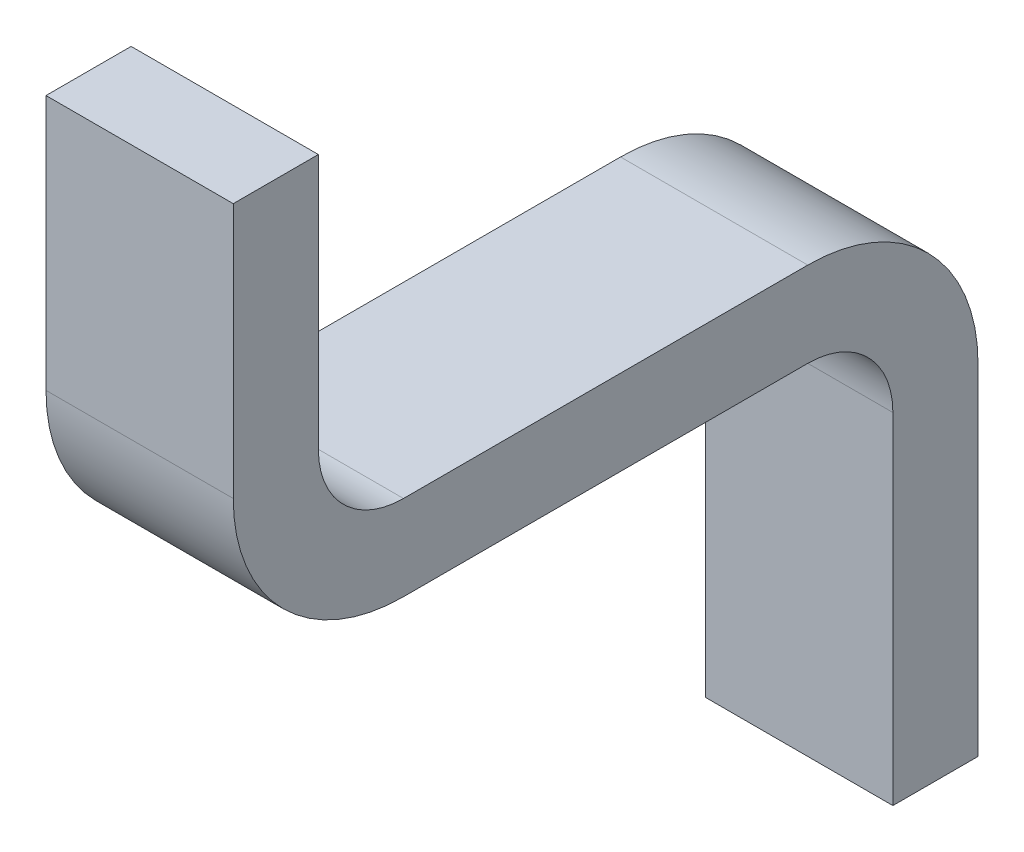
ISO-10303-21;
HEADER;
FILE_DESCRIPTION(('STEP AP214'),'2;1');
FILE_NAME('part.step','',(''),(''),'','','');
FILE_SCHEMA(('AUTOMOTIVE_DESIGN { 1 0 10303 214 1 1 1 1 }'));
ENDSEC;
DATA;
#1=APPLICATION_CONTEXT('core data for automotive mechanical design processes');
#2=APPLICATION_PROTOCOL_DEFINITION('international standard','automotive_design',2000,#1);
#3=PRODUCT_CONTEXT('',#1,'mechanical');
#4=PRODUCT('Part','Part','',(#3));
#5=PRODUCT_RELATED_PRODUCT_CATEGORY('part','',(#4));
#6=PRODUCT_DEFINITION_FORMATION('','',#4);
#7=PRODUCT_DEFINITION_CONTEXT('part definition',#1,'design');
#8=PRODUCT_DEFINITION('design','',#6,#7);
#9=PRODUCT_DEFINITION_SHAPE('','',#8);
#10=(LENGTH_UNIT() NAMED_UNIT(*) SI_UNIT(.MILLI.,.METRE.));
#11=(NAMED_UNIT(*) PLANE_ANGLE_UNIT() SI_UNIT($,.RADIAN.));
#12=(NAMED_UNIT(*) SI_UNIT($,.STERADIAN.) SOLID_ANGLE_UNIT());
#13=UNCERTAINTY_MEASURE_WITH_UNIT(LENGTH_MEASURE(1.E-05),#10,'distance_accuracy_value','');
#14=(GEOMETRIC_REPRESENTATION_CONTEXT(3) GLOBAL_UNCERTAINTY_ASSIGNED_CONTEXT((#13)) GLOBAL_UNIT_ASSIGNED_CONTEXT((#10,
#11,#12)) REPRESENTATION_CONTEXT('',''));
#15=CARTESIAN_POINT('',(0.,0.,0.));
#16=DIRECTION('',(0.,0.,1.));
#17=DIRECTION('',(1.,0.,0.));
#18=AXIS2_PLACEMENT_3D('',#15,#16,#17);
#19=CARTESIAN_POINT('',(1.64,-4.,0.675));
#20=DIRECTION('',(1.,0.,0.));
#21=DIRECTION('',(0.,1.,0.));
#22=AXIS2_PLACEMENT_3D('',#19,#20,#21);
#23=PLANE('',#22);
#24=CARTESIAN_POINT('',(1.64,-3.8,0.675));
#25=DIRECTION('',(-1.,0.,0.));
#26=DIRECTION('',(0.,-1.,0.));
#27=AXIS2_PLACEMENT_3D('',#24,#25,#26);
#28=CIRCLE('',#27,0.2);
#29=CARTESIAN_POINT('',(1.64,-3.8,0.875));
#30=VERTEX_POINT('',#29);
#31=CARTESIAN_POINT('',(1.64,-4.,0.675));
#32=VERTEX_POINT('',#31);
#33=EDGE_CURVE('E150',#30,#32,#28,.F.);
#34=ORIENTED_EDGE('',*,*,#33,.F.);
#35=DIRECTION('',(0.,1.,0.));
#36=VECTOR('',#35,1.);
#37=CARTESIAN_POINT('',(1.64,-3.50000000000001,0.875));
#38=LINE('',#37,#36);
#39=CARTESIAN_POINT('',(1.64,-3.50000000000001,0.875));
#40=VERTEX_POINT('',#39);
#41=EDGE_CURVE('E147',#30,#40,#38,.T.);
#42=ORIENTED_EDGE('',*,*,#41,.T.);
#43=DIRECTION('',(0.,0.,1.));
#44=VECTOR('',#43,1.);
#45=CARTESIAN_POINT('',(1.64,-3.50000000000001,0.775));
#46=LINE('',#45,#44);
#47=CARTESIAN_POINT('',(1.64,-3.50000000000001,0.775));
#48=VERTEX_POINT('',#47);
#49=EDGE_CURVE('E141',#48,#40,#46,.T.);
#50=ORIENTED_EDGE('',*,*,#49,.F.);
#51=DIRECTION('',(0.,1.,0.));
#52=VECTOR('',#51,1.);
#53=CARTESIAN_POINT('',(1.64,-3.50000000000001,0.775));
#54=LINE('',#53,#52);
#55=CARTESIAN_POINT('',(1.64,-3.8,0.775));
#56=VERTEX_POINT('',#55);
#57=EDGE_CURVE('E115',#48,#56,#54,.F.);
#58=ORIENTED_EDGE('',*,*,#57,.T.);
#59=CARTESIAN_POINT('',(1.64,-3.8,0.675));
#60=DIRECTION('',(-1.,0.,0.));
#61=DIRECTION('',(0.,-1.,0.));
#62=AXIS2_PLACEMENT_3D('',#59,#60,#61);
#63=CIRCLE('',#62,0.1);
#64=CARTESIAN_POINT('',(1.64,-3.90000000000001,0.675));
#65=VERTEX_POINT('',#64);
#66=EDGE_CURVE('E215',#56,#65,#63,.F.);
#67=ORIENTED_EDGE('',*,*,#66,.T.);
#68=DIRECTION('',(0.,0.,1.));
#69=VECTOR('',#68,1.);
#70=CARTESIAN_POINT('',(1.64,-3.90000000000001,0.675));
#71=LINE('',#70,#69);
#72=CARTESIAN_POINT('',(1.64,-3.90000000000001,0.2));
#73=VERTEX_POINT('',#72);
#74=EDGE_CURVE('E181',#65,#73,#71,.F.);
#75=ORIENTED_EDGE('',*,*,#74,.T.);
#76=CARTESIAN_POINT('',(1.64,-4.1,0.2));
#77=DIRECTION('',(1.,0.,0.));
#78=DIRECTION('',(0.,1.,0.));
#79=AXIS2_PLACEMENT_3D('',#76,#77,#78);
#80=CIRCLE('',#79,0.2);
#81=CARTESIAN_POINT('',(1.64,-4.1,0.));
#82=VERTEX_POINT('',#81);
#83=EDGE_CURVE('E20',#82,#73,#80,.T.);
#84=ORIENTED_EDGE('',*,*,#83,.F.);
#85=DIRECTION('',(0.,1.,0.));
#86=VECTOR('',#85,1.);
#87=CARTESIAN_POINT('',(1.64,-4.1,0.));
#88=LINE('',#87,#86);
#89=CARTESIAN_POINT('',(1.64,-4.5,0.));
#90=VERTEX_POINT('',#89);
#91=EDGE_CURVE('E91',#82,#90,#88,.F.);
#92=ORIENTED_EDGE('',*,*,#91,.T.);
#93=DIRECTION('',(0.,0.,1.));
#94=VECTOR('',#93,1.);
#95=CARTESIAN_POINT('',(1.64,-4.5,0.));
#96=LINE('',#95,#94);
#97=CARTESIAN_POINT('',(1.64,-4.5,0.1));
#98=VERTEX_POINT('',#97);
#99=EDGE_CURVE('E163',#90,#98,#96,.T.);
#100=ORIENTED_EDGE('',*,*,#99,.T.);
#101=DIRECTION('',(0.,1.,0.));
#102=VECTOR('',#101,1.);
#103=CARTESIAN_POINT('',(1.64,-4.1,0.1));
#104=LINE('',#103,#102);
#105=CARTESIAN_POINT('',(1.64,-4.1,0.1));
#106=VERTEX_POINT('',#105);
#107=EDGE_CURVE('E159',#98,#106,#104,.T.);
#108=ORIENTED_EDGE('',*,*,#107,.T.);
#109=CARTESIAN_POINT('',(1.64,-4.1,0.2));
#110=DIRECTION('',(1.,0.,0.));
#111=DIRECTION('',(0.,1.,0.));
#112=AXIS2_PLACEMENT_3D('',#109,#110,#111);
#113=CIRCLE('',#112,0.1);
#114=CARTESIAN_POINT('',(1.64,-4.,0.2));
#115=VERTEX_POINT('',#114);
#116=EDGE_CURVE('E155',#106,#115,#113,.T.);
#117=ORIENTED_EDGE('',*,*,#116,.T.);
#118=DIRECTION('',(0.,0.,1.));
#119=VECTOR('',#118,1.);
#120=CARTESIAN_POINT('',(1.64,-4.,0.675));
#121=LINE('',#120,#119);
#122=EDGE_CURVE('E154',#115,#32,#121,.T.);
#123=ORIENTED_EDGE('',*,*,#122,.T.);
#124=EDGE_LOOP('',(#34,#42,#50,#58,#67,#75,#84,#92,#100,#108,#117,#123));
#125=FACE_BOUND('',#124,.T.);
#126=ADVANCED_FACE('F17',(#125),#23,.F.);
#127=CARTESIAN_POINT('',(1.64,-4.1,0.2));
#128=DIRECTION('',(1.,0.,0.));
#129=DIRECTION('',(0.,1.,0.));
#130=AXIS2_PLACEMENT_3D('',#127,#128,#129);
#131=CYLINDRICAL_SURFACE('',#130,0.2);
#132=CARTESIAN_POINT('',(1.86,-4.1,0.2));
#133=DIRECTION('',(1.,0.,0.));
#134=DIRECTION('',(0.,1.,0.));
#135=AXIS2_PLACEMENT_3D('',#132,#133,#134);
#136=CIRCLE('',#135,0.2);
#137=CARTESIAN_POINT('',(1.86,-3.9,0.2));
#138=VERTEX_POINT('',#137);
#139=CARTESIAN_POINT('',(1.86,-4.1,0.));
#140=VERTEX_POINT('',#139);
#141=EDGE_CURVE('E183',#138,#140,#136,.F.);
#142=ORIENTED_EDGE('',*,*,#141,.T.);
#143=DIRECTION('',(1.,0.,0.));
#144=VECTOR('',#143,1.);
#145=CARTESIAN_POINT('',(1.64,-4.1,0.));
#146=LINE('',#145,#144);
#147=EDGE_CURVE('E178',#140,#82,#146,.F.);
#148=ORIENTED_EDGE('',*,*,#147,.T.);
#149=ORIENTED_EDGE('',*,*,#83,.T.);
#150=DIRECTION('',(1.,0.,0.));
#151=VECTOR('',#150,1.);
#152=CARTESIAN_POINT('',(1.64,-3.90000000000001,0.2));
#153=LINE('',#152,#151);
#154=EDGE_CURVE('E217',#73,#138,#153,.T.);
#155=ORIENTED_EDGE('',*,*,#154,.T.);
#156=EDGE_LOOP('',(#142,#148,#149,#155));
#157=FACE_BOUND('',#156,.T.);
#158=ADVANCED_FACE('F254',(#157),#131,.T.);
#159=CARTESIAN_POINT('',(1.64,-4.1,0.));
#160=DIRECTION('',(0.,0.,1.));
#161=DIRECTION('',(1.,0.,0.));
#162=AXIS2_PLACEMENT_3D('',#159,#160,#161);
#163=PLANE('',#162);
#164=ORIENTED_EDGE('',*,*,#147,.F.);
#165=DIRECTION('',(0.,-1.,0.));
#166=VECTOR('',#165,1.);
#167=CARTESIAN_POINT('',(1.86,-3.9,0.));
#168=LINE('',#167,#166);
#169=CARTESIAN_POINT('',(1.86,-4.5,0.));
#170=VERTEX_POINT('',#169);
#171=EDGE_CURVE('E170',#140,#170,#168,.T.);
#172=ORIENTED_EDGE('',*,*,#171,.T.);
#173=DIRECTION('',(-1.,0.,0.));
#174=VECTOR('',#173,1.);
#175=CARTESIAN_POINT('',(1.64,-4.5,0.));
#176=LINE('',#175,#174);
#177=EDGE_CURVE('E173',#170,#90,#176,.T.);
#178=ORIENTED_EDGE('',*,*,#177,.T.);
#179=ORIENTED_EDGE('',*,*,#91,.F.);
#180=EDGE_LOOP('',(#164,#172,#178,#179));
#181=FACE_BOUND('',#180,.T.);
#182=ADVANCED_FACE('F257',(#181),#163,.F.);
#183=CARTESIAN_POINT('',(1.64,-4.5,0.));
#184=DIRECTION('',(0.,1.,0.));
#185=DIRECTION('',(-1.,0.,0.));
#186=AXIS2_PLACEMENT_3D('',#183,#184,#185);
#187=PLANE('',#186);
#188=DIRECTION('',(-1.,0.,0.));
#189=VECTOR('',#188,1.);
#190=CARTESIAN_POINT('',(1.86,-4.5,0.1));
#191=LINE('',#190,#189);
#192=CARTESIAN_POINT('',(1.86,-4.5,0.1));
#193=VERTEX_POINT('',#192);
#194=EDGE_CURVE('E160',#193,#98,#191,.T.);
#195=ORIENTED_EDGE('',*,*,#194,.T.);
#196=ORIENTED_EDGE('',*,*,#99,.F.);
#197=ORIENTED_EDGE('',*,*,#177,.F.);
#198=DIRECTION('',(0.,0.,1.));
#199=VECTOR('',#198,1.);
#200=CARTESIAN_POINT('',(1.86,-4.5,0.675));
#201=LINE('',#200,#199);
#202=EDGE_CURVE('E166',#170,#193,#201,.T.);
#203=ORIENTED_EDGE('',*,*,#202,.T.);
#204=EDGE_LOOP('',(#195,#196,#197,#203));
#205=FACE_BOUND('',#204,.T.);
#206=ADVANCED_FACE('F259',(#205),#187,.F.);
#207=CARTESIAN_POINT('',(1.86,-4.1,0.1));
#208=DIRECTION('',(0.,0.,-1.));
#209=DIRECTION('',(-1.,0.,0.));
#210=AXIS2_PLACEMENT_3D('',#207,#208,#209);
#211=PLANE('',#210);
#212=DIRECTION('',(1.,0.,0.));
#213=VECTOR('',#212,1.);
#214=CARTESIAN_POINT('',(1.86,-4.1,0.1));
#215=LINE('',#214,#213);
#216=CARTESIAN_POINT('',(1.86,-4.1,0.1));
#217=VERTEX_POINT('',#216);
#218=EDGE_CURVE('E156',#217,#106,#215,.F.);
#219=ORIENTED_EDGE('',*,*,#218,.T.);
#220=ORIENTED_EDGE('',*,*,#107,.F.);
#221=ORIENTED_EDGE('',*,*,#194,.F.);
#222=DIRECTION('',(0.,-1.,0.));
#223=VECTOR('',#222,1.);
#224=CARTESIAN_POINT('',(1.86,-3.9,0.1));
#225=LINE('',#224,#223);
#226=EDGE_CURVE('E169',#193,#217,#225,.F.);
#227=ORIENTED_EDGE('',*,*,#226,.T.);
#228=EDGE_LOOP('',(#219,#220,#221,#227));
#229=FACE_BOUND('',#228,.T.);
#230=ADVANCED_FACE('F234',(#229),#211,.F.);
#231=CARTESIAN_POINT('',(1.86,-4.1,0.2));
#232=DIRECTION('',(1.,0.,0.));
#233=DIRECTION('',(0.,1.,0.));
#234=AXIS2_PLACEMENT_3D('',#231,#232,#233);
#235=CYLINDRICAL_SURFACE('',#234,0.1);
#236=DIRECTION('',(-1.,0.,0.));
#237=VECTOR('',#236,1.);
#238=CARTESIAN_POINT('',(1.86,-4.,0.2));
#239=LINE('',#238,#237);
#240=CARTESIAN_POINT('',(1.86,-4.,0.2));
#241=VERTEX_POINT('',#240);
#242=EDGE_CURVE('E151',#241,#115,#239,.T.);
#243=ORIENTED_EDGE('',*,*,#242,.T.);
#244=ORIENTED_EDGE('',*,*,#116,.F.);
#245=ORIENTED_EDGE('',*,*,#218,.F.);
#246=CARTESIAN_POINT('',(1.86,-4.1,0.2));
#247=DIRECTION('',(1.,0.,0.));
#248=DIRECTION('',(0.,1.,0.));
#249=AXIS2_PLACEMENT_3D('',#246,#247,#248);
#250=CIRCLE('',#249,0.1);
#251=EDGE_CURVE('E210',#217,#241,#250,.T.);
#252=ORIENTED_EDGE('',*,*,#251,.T.);
#253=EDGE_LOOP('',(#243,#244,#245,#252));
#254=FACE_BOUND('',#253,.T.);
#255=ADVANCED_FACE('F227',(#254),#235,.F.);
#256=CARTESIAN_POINT('',(1.86,-4.,0.675));
#257=DIRECTION('',(0.,1.,0.));
#258=DIRECTION('',(-1.,0.,0.));
#259=AXIS2_PLACEMENT_3D('',#256,#257,#258);
#260=PLANE('',#259);
#261=DIRECTION('',(-1.,0.,0.));
#262=VECTOR('',#261,1.);
#263=CARTESIAN_POINT('',(1.86,-4.,0.675));
#264=LINE('',#263,#262);
#265=CARTESIAN_POINT('',(1.86,-4.,0.675));
#266=VERTEX_POINT('',#265);
#267=EDGE_CURVE('E148',#32,#266,#264,.F.);
#268=ORIENTED_EDGE('',*,*,#267,.F.);
#269=ORIENTED_EDGE('',*,*,#122,.F.);
#270=ORIENTED_EDGE('',*,*,#242,.F.);
#271=DIRECTION('',(0.,0.,1.));
#272=VECTOR('',#271,1.);
#273=CARTESIAN_POINT('',(1.86,-4.,0.675));
#274=LINE('',#273,#272);
#275=EDGE_CURVE('E209',#241,#266,#274,.T.);
#276=ORIENTED_EDGE('',*,*,#275,.T.);
#277=EDGE_LOOP('',(#268,#269,#270,#276));
#278=FACE_BOUND('',#277,.T.);
#279=ADVANCED_FACE('F224',(#278),#260,.F.);
#280=CARTESIAN_POINT('',(1.86,-3.8,0.675));
#281=DIRECTION('',(-1.,0.,0.));
#282=DIRECTION('',(0.,-1.,0.));
#283=AXIS2_PLACEMENT_3D('',#280,#281,#282);
#284=CYLINDRICAL_SURFACE('',#283,0.2);
#285=ORIENTED_EDGE('',*,*,#33,.T.);
#286=ORIENTED_EDGE('',*,*,#267,.T.);
#287=CARTESIAN_POINT('',(1.86,-3.8,0.675));
#288=DIRECTION('',(-1.,0.,0.));
#289=DIRECTION('',(0.,-1.,0.));
#290=AXIS2_PLACEMENT_3D('',#287,#288,#289);
#291=CIRCLE('',#290,0.2);
#292=CARTESIAN_POINT('',(1.86,-3.8,0.875));
#293=VERTEX_POINT('',#292);
#294=EDGE_CURVE('E133',#266,#293,#291,.T.);
#295=ORIENTED_EDGE('',*,*,#294,.T.);
#296=DIRECTION('',(-1.,0.,0.));
#297=VECTOR('',#296,1.);
#298=CARTESIAN_POINT('',(1.86,-3.8,0.875));
#299=LINE('',#298,#297);
#300=EDGE_CURVE('E144',#293,#30,#299,.T.);
#301=ORIENTED_EDGE('',*,*,#300,.T.);
#302=EDGE_LOOP('',(#285,#286,#295,#301));
#303=FACE_BOUND('',#302,.T.);
#304=ADVANCED_FACE('F285',(#303),#284,.T.);
#305=CARTESIAN_POINT('',(1.86,-3.50000000000001,0.875));
#306=DIRECTION('',(0.,0.,-1.));
#307=DIRECTION('',(-1.,0.,0.));
#308=AXIS2_PLACEMENT_3D('',#305,#306,#307);
#309=PLANE('',#308);
#310=DIRECTION('',(-1.,0.,0.));
#311=VECTOR('',#310,1.);
#312=CARTESIAN_POINT('',(1.64,-3.50000000000001,0.875));
#313=LINE('',#312,#311);
#314=CARTESIAN_POINT('',(1.86,-3.50000000000001,0.875));
#315=VERTEX_POINT('',#314);
#316=EDGE_CURVE('E118',#40,#315,#313,.F.);
#317=ORIENTED_EDGE('',*,*,#316,.F.);
#318=ORIENTED_EDGE('',*,*,#41,.F.);
#319=ORIENTED_EDGE('',*,*,#300,.F.);
#320=DIRECTION('',(0.,-1.,0.));
#321=VECTOR('',#320,1.);
#322=CARTESIAN_POINT('',(1.86,-3.9,0.875));
#323=LINE('',#322,#321);
#324=EDGE_CURVE('E131',#293,#315,#323,.F.);
#325=ORIENTED_EDGE('',*,*,#324,.T.);
#326=EDGE_LOOP('',(#317,#318,#319,#325));
#327=FACE_BOUND('',#326,.T.);
#328=ADVANCED_FACE('F282',(#327),#309,.F.);
#329=CARTESIAN_POINT('',(1.64,-3.50000000000001,0.775));
#330=DIRECTION('',(0.,1.,0.));
#331=DIRECTION('',(-1.,0.,0.));
#332=AXIS2_PLACEMENT_3D('',#329,#330,#331);
#333=PLANE('',#332);
#334=ORIENTED_EDGE('',*,*,#49,.T.);
#335=ORIENTED_EDGE('',*,*,#316,.T.);
#336=DIRECTION('',(0.,0.,1.));
#337=VECTOR('',#336,1.);
#338=CARTESIAN_POINT('',(1.86,-3.50000000000001,0.675));
#339=LINE('',#338,#337);
#340=CARTESIAN_POINT('',(1.86,-3.50000000000001,0.775));
#341=VERTEX_POINT('',#340);
#342=EDGE_CURVE('E125',#315,#341,#339,.F.);
#343=ORIENTED_EDGE('',*,*,#342,.T.);
#344=DIRECTION('',(1.,0.,0.));
#345=VECTOR('',#344,1.);
#346=CARTESIAN_POINT('',(1.64,-3.50000000000001,0.775));
#347=LINE('',#346,#345);
#348=EDGE_CURVE('E110',#341,#48,#347,.F.);
#349=ORIENTED_EDGE('',*,*,#348,.T.);
#350=EDGE_LOOP('',(#334,#335,#343,#349));
#351=FACE_BOUND('',#350,.T.);
#352=ADVANCED_FACE('F129',(#351),#333,.T.);
#353=CARTESIAN_POINT('',(1.64,-3.50000000000001,0.775));
#354=DIRECTION('',(0.,0.,1.));
#355=DIRECTION('',(1.,0.,0.));
#356=AXIS2_PLACEMENT_3D('',#353,#354,#355);
#357=PLANE('',#356);
#358=ORIENTED_EDGE('',*,*,#348,.F.);
#359=DIRECTION('',(0.,-1.,0.));
#360=VECTOR('',#359,1.);
#361=CARTESIAN_POINT('',(1.86,-3.9,0.775));
#362=LINE('',#361,#360);
#363=CARTESIAN_POINT('',(1.86,-3.8,0.775));
#364=VERTEX_POINT('',#363);
#365=EDGE_CURVE('E114',#341,#364,#362,.T.);
#366=ORIENTED_EDGE('',*,*,#365,.T.);
#367=DIRECTION('',(-1.,0.,0.));
#368=VECTOR('',#367,1.);
#369=CARTESIAN_POINT('',(1.64,-3.8,0.775));
#370=LINE('',#369,#368);
#371=EDGE_CURVE('E185',#364,#56,#370,.T.);
#372=ORIENTED_EDGE('',*,*,#371,.T.);
#373=ORIENTED_EDGE('',*,*,#57,.F.);
#374=EDGE_LOOP('',(#358,#366,#372,#373));
#375=FACE_BOUND('',#374,.T.);
#376=ADVANCED_FACE('F112',(#375),#357,.F.);
#377=CARTESIAN_POINT('',(1.64,-3.8,0.675));
#378=DIRECTION('',(-1.,0.,0.));
#379=DIRECTION('',(0.,-1.,0.));
#380=AXIS2_PLACEMENT_3D('',#377,#378,#379);
#381=CYLINDRICAL_SURFACE('',#380,0.1);
#382=ORIENTED_EDGE('',*,*,#371,.F.);
#383=CARTESIAN_POINT('',(1.86,-3.8,0.675));
#384=DIRECTION('',(-1.,0.,0.));
#385=DIRECTION('',(0.,-1.,0.));
#386=AXIS2_PLACEMENT_3D('',#383,#384,#385);
#387=CIRCLE('',#386,0.1);
#388=CARTESIAN_POINT('',(1.86,-3.9,0.675));
#389=VERTEX_POINT('',#388);
#390=EDGE_CURVE('E26',#364,#389,#387,.F.);
#391=ORIENTED_EDGE('',*,*,#390,.T.);
#392=DIRECTION('',(1.,0.,0.));
#393=VECTOR('',#392,1.);
#394=CARTESIAN_POINT('',(1.64,-3.90000000000001,0.675));
#395=LINE('',#394,#393);
#396=EDGE_CURVE('E34',#389,#65,#395,.F.);
#397=ORIENTED_EDGE('',*,*,#396,.T.);
#398=ORIENTED_EDGE('',*,*,#66,.F.);
#399=EDGE_LOOP('',(#382,#391,#397,#398));
#400=FACE_BOUND('',#399,.T.);
#401=ADVANCED_FACE('F250',(#400),#381,.F.);
#402=CARTESIAN_POINT('',(1.64,-3.90000000000001,0.675));
#403=DIRECTION('',(0.,-1.,0.));
#404=DIRECTION('',(1.,0.,0.));
#405=AXIS2_PLACEMENT_3D('',#402,#403,#404);
#406=PLANE('',#405);
#407=ORIENTED_EDGE('',*,*,#396,.F.);
#408=DIRECTION('',(0.,0.,1.));
#409=VECTOR('',#408,1.);
#410=CARTESIAN_POINT('',(1.86,-3.9,0.675));
#411=LINE('',#410,#409);
#412=EDGE_CURVE('E11',#389,#138,#411,.F.);
#413=ORIENTED_EDGE('',*,*,#412,.T.);
#414=ORIENTED_EDGE('',*,*,#154,.F.);
#415=ORIENTED_EDGE('',*,*,#74,.F.);
#416=EDGE_LOOP('',(#407,#413,#414,#415));
#417=FACE_BOUND('',#416,.T.);
#418=ADVANCED_FACE('F252',(#417),#406,.F.);
#419=CARTESIAN_POINT('',(1.86,-3.9,0.675));
#420=DIRECTION('',(-1.,0.,0.));
#421=DIRECTION('',(0.,-1.,0.));
#422=AXIS2_PLACEMENT_3D('',#419,#420,#421);
#423=PLANE('',#422);
#424=ORIENTED_EDGE('',*,*,#390,.F.);
#425=ORIENTED_EDGE('',*,*,#365,.F.);
#426=ORIENTED_EDGE('',*,*,#342,.F.);
#427=ORIENTED_EDGE('',*,*,#324,.F.);
#428=ORIENTED_EDGE('',*,*,#294,.F.);
#429=ORIENTED_EDGE('',*,*,#275,.F.);
#430=ORIENTED_EDGE('',*,*,#251,.F.);
#431=ORIENTED_EDGE('',*,*,#226,.F.);
#432=ORIENTED_EDGE('',*,*,#202,.F.);
#433=ORIENTED_EDGE('',*,*,#171,.F.);
#434=ORIENTED_EDGE('',*,*,#141,.F.);
#435=ORIENTED_EDGE('',*,*,#412,.F.);
#436=EDGE_LOOP('',(#424,#425,#426,#427,#428,#429,#430,#431,#432,#433,#434,#435));
#437=FACE_BOUND('',#436,.T.);
#438=ADVANCED_FACE('F123',(#437),#423,.F.);
#439=CLOSED_SHELL('',(#126,#158,#182,#206,#230,#255,#279,#304,#328,#352,#376,#401,#418,#438));
#440=MANIFOLD_SOLID_BREP('B1',#439);
#441=ADVANCED_BREP_SHAPE_REPRESENTATION('',(#18,#440),#14);
#442=SHAPE_DEFINITION_REPRESENTATION(#9,#441);
ENDSEC;
END-ISO-10303-21;
